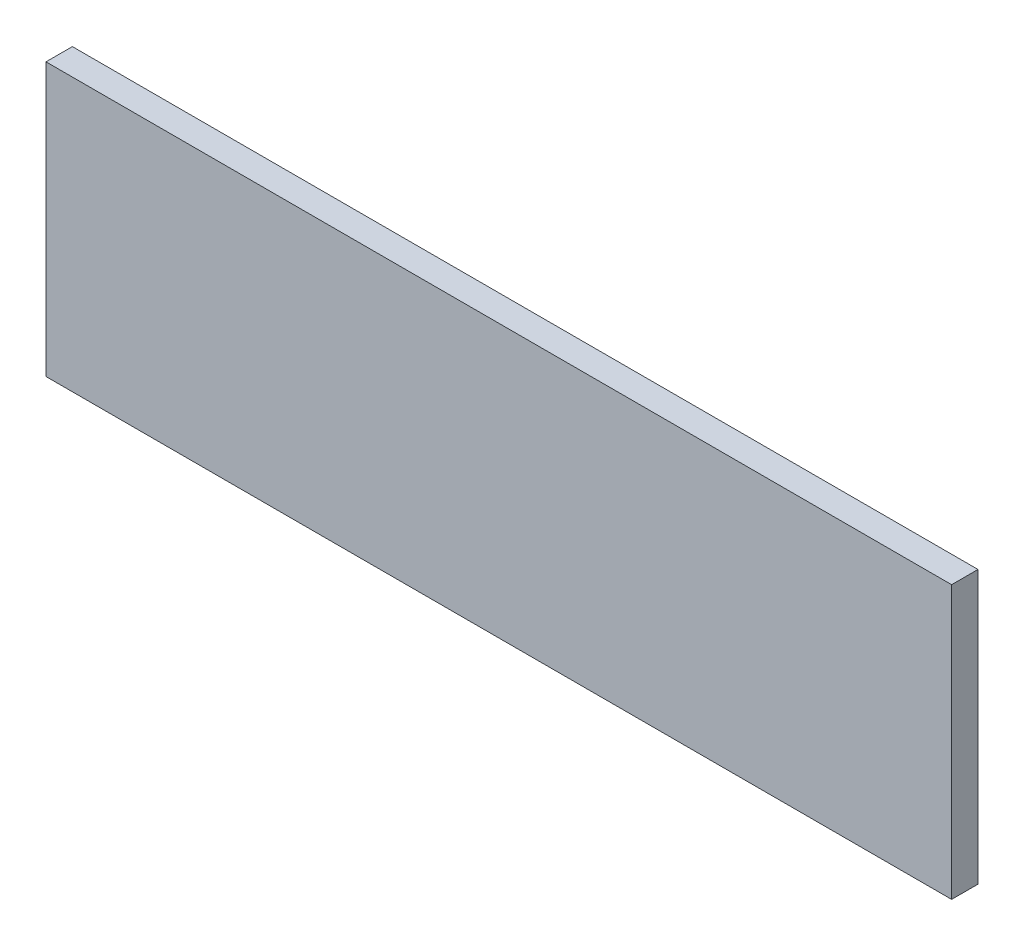
ISO-10303-21;
HEADER;
FILE_DESCRIPTION(('STEP AP214'),'2;1');
FILE_NAME('part.step','',(''),(''),'','','');
FILE_SCHEMA(('AUTOMOTIVE_DESIGN { 1 0 10303 214 1 1 1 1 }'));
ENDSEC;
DATA;
#1=APPLICATION_CONTEXT('core data for automotive mechanical design processes');
#2=APPLICATION_PROTOCOL_DEFINITION('international standard','automotive_design',2000,#1);
#3=PRODUCT_CONTEXT('',#1,'mechanical');
#4=PRODUCT('Part','Part','',(#3));
#5=PRODUCT_RELATED_PRODUCT_CATEGORY('part','',(#4));
#6=PRODUCT_DEFINITION_FORMATION('','',#4);
#7=PRODUCT_DEFINITION_CONTEXT('part definition',#1,'design');
#8=PRODUCT_DEFINITION('design','',#6,#7);
#9=PRODUCT_DEFINITION_SHAPE('','',#8);
#10=(LENGTH_UNIT() NAMED_UNIT(*) SI_UNIT(.MILLI.,.METRE.));
#11=(NAMED_UNIT(*) PLANE_ANGLE_UNIT() SI_UNIT($,.RADIAN.));
#12=(NAMED_UNIT(*) SI_UNIT($,.STERADIAN.) SOLID_ANGLE_UNIT());
#13=UNCERTAINTY_MEASURE_WITH_UNIT(LENGTH_MEASURE(1.E-05),#10,'distance_accuracy_value','');
#14=(GEOMETRIC_REPRESENTATION_CONTEXT(3) GLOBAL_UNCERTAINTY_ASSIGNED_CONTEXT((#13)) GLOBAL_UNIT_ASSIGNED_CONTEXT((#10,
#11,#12)) REPRESENTATION_CONTEXT('',''));
#15=CARTESIAN_POINT('',(0.,0.,0.));
#16=DIRECTION('',(0.,0.,1.));
#17=DIRECTION('',(1.,0.,0.));
#18=AXIS2_PLACEMENT_3D('',#15,#16,#17);
#19=CARTESIAN_POINT('',(51.5,15.5,3.));
#20=DIRECTION('',(-1.,0.,0.));
#21=DIRECTION('',(0.,0.,1.));
#22=AXIS2_PLACEMENT_3D('',#19,#20,#21);
#23=PLANE('',#22);
#24=DIRECTION('',(0.,1.,0.));
#25=VECTOR('',#24,1.);
#26=CARTESIAN_POINT('',(51.5,15.5,0.));
#27=LINE('',#26,#25);
#28=CARTESIAN_POINT('',(51.5,-15.5,0.));
#29=VERTEX_POINT('',#28);
#30=CARTESIAN_POINT('',(51.5,15.5,0.));
#31=VERTEX_POINT('',#30);
#32=EDGE_CURVE('E96',#29,#31,#27,.T.);
#33=ORIENTED_EDGE('',*,*,#32,.T.);
#34=DIRECTION('',(0.,0.,-1.));
#35=VECTOR('',#34,1.);
#36=CARTESIAN_POINT('',(51.5,15.5,3.));
#37=LINE('',#36,#35);
#38=CARTESIAN_POINT('',(51.5,15.5,3.));
#39=VERTEX_POINT('',#38);
#40=EDGE_CURVE('E11',#39,#31,#37,.T.);
#41=ORIENTED_EDGE('',*,*,#40,.F.);
#42=DIRECTION('',(0.,1.,0.));
#43=VECTOR('',#42,1.);
#44=CARTESIAN_POINT('',(51.5,15.5,3.));
#45=LINE('',#44,#43);
#46=CARTESIAN_POINT('',(51.5,-15.5,3.));
#47=VERTEX_POINT('',#46);
#48=EDGE_CURVE('E84',#47,#39,#45,.T.);
#49=ORIENTED_EDGE('',*,*,#48,.F.);
#50=DIRECTION('',(0.,0.,-1.));
#51=VECTOR('',#50,1.);
#52=CARTESIAN_POINT('',(51.5,-15.5,3.));
#53=LINE('',#52,#51);
#54=EDGE_CURVE('E92',#47,#29,#53,.T.);
#55=ORIENTED_EDGE('',*,*,#54,.T.);
#56=EDGE_LOOP('',(#33,#41,#49,#55));
#57=FACE_BOUND('',#56,.T.);
#58=ADVANCED_FACE('F33',(#57),#23,.F.);
#59=CARTESIAN_POINT('',(-51.5,15.5,3.));
#60=DIRECTION('',(0.,-1.,0.));
#61=DIRECTION('',(0.,0.,-1.));
#62=AXIS2_PLACEMENT_3D('',#59,#60,#61);
#63=PLANE('',#62);
#64=DIRECTION('',(-1.,0.,0.));
#65=VECTOR('',#64,1.);
#66=CARTESIAN_POINT('',(-51.5,15.5,0.));
#67=LINE('',#66,#65);
#68=CARTESIAN_POINT('',(-51.5,15.5,0.));
#69=VERTEX_POINT('',#68);
#70=EDGE_CURVE('E88',#31,#69,#67,.T.);
#71=ORIENTED_EDGE('',*,*,#70,.T.);
#72=DIRECTION('',(0.,0.,-1.));
#73=VECTOR('',#72,1.);
#74=CARTESIAN_POINT('',(-51.5,15.5,3.));
#75=LINE('',#74,#73);
#76=CARTESIAN_POINT('',(-51.5,15.5,3.));
#77=VERTEX_POINT('',#76);
#78=EDGE_CURVE('E41',#77,#69,#75,.T.);
#79=ORIENTED_EDGE('',*,*,#78,.F.);
#80=DIRECTION('',(-1.,0.,0.));
#81=VECTOR('',#80,1.);
#82=CARTESIAN_POINT('',(-51.5,15.5,3.));
#83=LINE('',#82,#81);
#84=EDGE_CURVE('E79',#39,#77,#83,.T.);
#85=ORIENTED_EDGE('',*,*,#84,.F.);
#86=ORIENTED_EDGE('',*,*,#40,.T.);
#87=EDGE_LOOP('',(#71,#79,#85,#86));
#88=FACE_BOUND('',#87,.T.);
#89=ADVANCED_FACE('F87',(#88),#63,.F.);
#90=CARTESIAN_POINT('',(-51.5,15.5,3.));
#91=DIRECTION('',(1.,0.,0.));
#92=DIRECTION('',(0.,1.,0.));
#93=AXIS2_PLACEMENT_3D('',#90,#91,#92);
#94=PLANE('',#93);
#95=DIRECTION('',(0.,-1.,0.));
#96=VECTOR('',#95,1.);
#97=CARTESIAN_POINT('',(-51.5,15.5,0.));
#98=LINE('',#97,#96);
#99=CARTESIAN_POINT('',(-51.5,-15.5,0.));
#100=VERTEX_POINT('',#99);
#101=EDGE_CURVE('E66',#69,#100,#98,.T.);
#102=ORIENTED_EDGE('',*,*,#101,.T.);
#103=DIRECTION('',(0.,0.,-1.));
#104=VECTOR('',#103,1.);
#105=CARTESIAN_POINT('',(-51.5,-15.5,3.));
#106=LINE('',#105,#104);
#107=CARTESIAN_POINT('',(-51.5,-15.5,3.));
#108=VERTEX_POINT('',#107);
#109=EDGE_CURVE('E89',#108,#100,#106,.T.);
#110=ORIENTED_EDGE('',*,*,#109,.F.);
#111=DIRECTION('',(0.,-1.,0.));
#112=VECTOR('',#111,1.);
#113=CARTESIAN_POINT('',(-51.5,15.5,3.));
#114=LINE('',#113,#112);
#115=EDGE_CURVE('E82',#77,#108,#114,.T.);
#116=ORIENTED_EDGE('',*,*,#115,.F.);
#117=ORIENTED_EDGE('',*,*,#78,.T.);
#118=EDGE_LOOP('',(#102,#110,#116,#117));
#119=FACE_BOUND('',#118,.T.);
#120=ADVANCED_FACE('F90',(#119),#94,.F.);
#121=CARTESIAN_POINT('',(-51.5,-15.5,3.));
#122=DIRECTION('',(0.,1.,0.));
#123=DIRECTION('',(0.,0.,1.));
#124=AXIS2_PLACEMENT_3D('',#121,#122,#123);
#125=PLANE('',#124);
#126=DIRECTION('',(1.,0.,0.));
#127=VECTOR('',#126,1.);
#128=CARTESIAN_POINT('',(-51.5,-15.5,0.));
#129=LINE('',#128,#127);
#130=EDGE_CURVE('E72',#100,#29,#129,.T.);
#131=ORIENTED_EDGE('',*,*,#130,.T.);
#132=ORIENTED_EDGE('',*,*,#54,.F.);
#133=DIRECTION('',(1.,0.,0.));
#134=VECTOR('',#133,1.);
#135=CARTESIAN_POINT('',(-51.5,-15.5,3.));
#136=LINE('',#135,#134);
#137=EDGE_CURVE('E49',#108,#47,#136,.T.);
#138=ORIENTED_EDGE('',*,*,#137,.F.);
#139=ORIENTED_EDGE('',*,*,#109,.T.);
#140=EDGE_LOOP('',(#131,#132,#138,#139));
#141=FACE_BOUND('',#140,.T.);
#142=ADVANCED_FACE('F103',(#141),#125,.F.);
#143=CARTESIAN_POINT('',(0.,0.,3.));
#144=DIRECTION('',(0.,0.,1.));
#145=DIRECTION('',(1.,0.,0.));
#146=AXIS2_PLACEMENT_3D('',#143,#144,#145);
#147=PLANE('',#146);
#148=ORIENTED_EDGE('',*,*,#48,.T.);
#149=ORIENTED_EDGE('',*,*,#84,.T.);
#150=ORIENTED_EDGE('',*,*,#115,.T.);
#151=ORIENTED_EDGE('',*,*,#137,.T.);
#152=EDGE_LOOP('',(#148,#149,#150,#151));
#153=FACE_BOUND('',#152,.T.);
#154=ADVANCED_FACE('F80',(#153),#147,.T.);
#155=CARTESIAN_POINT('',(0.,0.,0.));
#156=DIRECTION('',(0.,0.,1.));
#157=DIRECTION('',(1.,0.,0.));
#158=AXIS2_PLACEMENT_3D('',#155,#156,#157);
#159=PLANE('',#158);
#160=ORIENTED_EDGE('',*,*,#32,.F.);
#161=ORIENTED_EDGE('',*,*,#130,.F.);
#162=ORIENTED_EDGE('',*,*,#101,.F.);
#163=ORIENTED_EDGE('',*,*,#70,.F.);
#164=EDGE_LOOP('',(#160,#161,#162,#163));
#165=FACE_BOUND('',#164,.T.);
#166=ADVANCED_FACE('F106',(#165),#159,.F.);
#167=CLOSED_SHELL('',(#58,#89,#120,#142,#154,#166));
#168=MANIFOLD_SOLID_BREP('B2',#167);
#169=ADVANCED_BREP_SHAPE_REPRESENTATION('',(#18,#168),#14);
#170=SHAPE_DEFINITION_REPRESENTATION(#9,#169);
ENDSEC;
END-ISO-10303-21;
